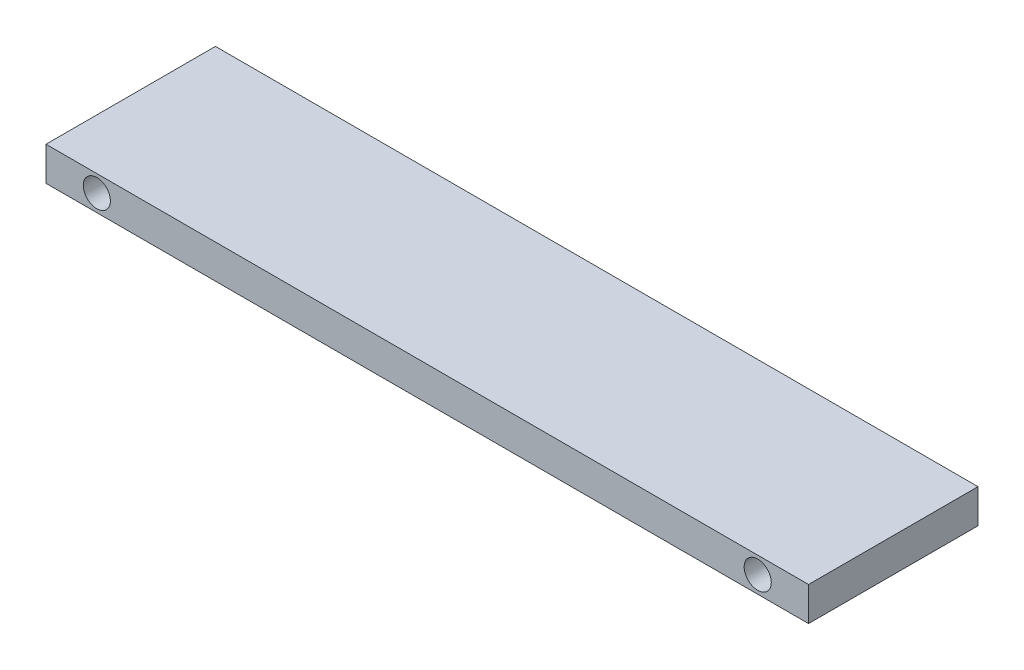
ISO-10303-21;
HEADER;
FILE_DESCRIPTION(('STEP AP214'),'2;1');
FILE_NAME('part.step','',(''),(''),'','','');
FILE_SCHEMA(('AUTOMOTIVE_DESIGN { 1 0 10303 214 1 1 1 1 }'));
ENDSEC;
DATA;
#1=APPLICATION_CONTEXT('core data for automotive mechanical design processes');
#2=APPLICATION_PROTOCOL_DEFINITION('international standard','automotive_design',2000,#1);
#3=PRODUCT_CONTEXT('',#1,'mechanical');
#4=PRODUCT('Part','Part','',(#3));
#5=PRODUCT_RELATED_PRODUCT_CATEGORY('part','',(#4));
#6=PRODUCT_DEFINITION_FORMATION('','',#4);
#7=PRODUCT_DEFINITION_CONTEXT('part definition',#1,'design');
#8=PRODUCT_DEFINITION('design','',#6,#7);
#9=PRODUCT_DEFINITION_SHAPE('','',#8);
#10=(LENGTH_UNIT() NAMED_UNIT(*) SI_UNIT(.MILLI.,.METRE.));
#11=(NAMED_UNIT(*) PLANE_ANGLE_UNIT() SI_UNIT($,.RADIAN.));
#12=(NAMED_UNIT(*) SI_UNIT($,.STERADIAN.) SOLID_ANGLE_UNIT());
#13=UNCERTAINTY_MEASURE_WITH_UNIT(LENGTH_MEASURE(1.E-05),#10,'distance_accuracy_value','');
#14=(GEOMETRIC_REPRESENTATION_CONTEXT(3) GLOBAL_UNCERTAINTY_ASSIGNED_CONTEXT((#13)) GLOBAL_UNIT_ASSIGNED_CONTEXT((#10,
#11,#12)) REPRESENTATION_CONTEXT('',''));
#15=CARTESIAN_POINT('',(0.,0.,0.));
#16=DIRECTION('',(0.,0.,1.));
#17=DIRECTION('',(1.,0.,0.));
#18=AXIS2_PLACEMENT_3D('',#15,#16,#17);
#19=CARTESIAN_POINT('',(225.,20.,50.));
#20=DIRECTION('',(-1.,0.,0.));
#21=DIRECTION('',(0.,0.,1.));
#22=AXIS2_PLACEMENT_3D('',#19,#20,#21);
#23=PLANE('',#22);
#24=DIRECTION('',(0.,0.,-1.));
#25=VECTOR('',#24,1.);
#26=CARTESIAN_POINT('',(225.,0.,50.));
#27=LINE('',#26,#25);
#28=CARTESIAN_POINT('',(225.,0.,50.));
#29=VERTEX_POINT('',#28);
#30=CARTESIAN_POINT('',(225.,0.,-50.));
#31=VERTEX_POINT('',#30);
#32=EDGE_CURVE('E96',#29,#31,#27,.T.);
#33=ORIENTED_EDGE('',*,*,#32,.T.);
#34=DIRECTION('',(0.,-1.,0.));
#35=VECTOR('',#34,1.);
#36=CARTESIAN_POINT('',(225.,20.,-50.));
#37=LINE('',#36,#35);
#38=CARTESIAN_POINT('',(225.,20.,-50.));
#39=VERTEX_POINT('',#38);
#40=EDGE_CURVE('E11',#39,#31,#37,.T.);
#41=ORIENTED_EDGE('',*,*,#40,.F.);
#42=DIRECTION('',(0.,0.,-1.));
#43=VECTOR('',#42,1.);
#44=CARTESIAN_POINT('',(225.,20.,50.));
#45=LINE('',#44,#43);
#46=CARTESIAN_POINT('',(225.,20.,50.));
#47=VERTEX_POINT('',#46);
#48=EDGE_CURVE('E84',#47,#39,#45,.T.);
#49=ORIENTED_EDGE('',*,*,#48,.F.);
#50=DIRECTION('',(0.,-1.,0.));
#51=VECTOR('',#50,1.);
#52=CARTESIAN_POINT('',(225.,20.,50.));
#53=LINE('',#52,#51);
#54=EDGE_CURVE('E92',#47,#29,#53,.T.);
#55=ORIENTED_EDGE('',*,*,#54,.T.);
#56=EDGE_LOOP('',(#33,#41,#49,#55));
#57=FACE_BOUND('',#56,.T.);
#58=ADVANCED_FACE('F33',(#57),#23,.F.);
#59=CARTESIAN_POINT('',(-225.,20.,-50.));
#60=DIRECTION('',(0.,0.,1.));
#61=DIRECTION('',(1.,0.,0.));
#62=AXIS2_PLACEMENT_3D('',#59,#60,#61);
#63=PLANE('',#62);
#64=CARTESIAN_POINT('',(-195.,10.,-50.));
#65=DIRECTION('',(0.,0.,1.));
#66=DIRECTION('',(-1.,0.,0.));
#67=AXIS2_PLACEMENT_3D('',#64,#65,#66);
#68=CIRCLE('',#67,7.99999999999998);
#69=CARTESIAN_POINT('',(-203.,10.,-50.));
#70=VERTEX_POINT('',#69);
#71=EDGE_CURVE('E113',#70,#70,#68,.T.);
#72=ORIENTED_EDGE('',*,*,#71,.T.);
#73=EDGE_LOOP('',(#72));
#74=FACE_BOUND('',#73,.T.);
#75=CARTESIAN_POINT('',(195.,10.,-50.));
#76=DIRECTION('',(0.,0.,1.));
#77=DIRECTION('',(1.,0.,0.));
#78=AXIS2_PLACEMENT_3D('',#75,#76,#77);
#79=CIRCLE('',#78,8.00000000000001);
#80=CARTESIAN_POINT('',(203.,10.,-50.));
#81=VERTEX_POINT('',#80);
#82=EDGE_CURVE('E99',#81,#81,#79,.T.);
#83=ORIENTED_EDGE('',*,*,#82,.T.);
#84=EDGE_LOOP('',(#83));
#85=FACE_BOUND('',#84,.T.);
#86=DIRECTION('',(-1.,0.,0.));
#87=VECTOR('',#86,1.);
#88=CARTESIAN_POINT('',(-225.,0.,-50.));
#89=LINE('',#88,#87);
#90=CARTESIAN_POINT('',(-225.,0.,-50.));
#91=VERTEX_POINT('',#90);
#92=EDGE_CURVE('E88',#31,#91,#89,.T.);
#93=ORIENTED_EDGE('',*,*,#92,.T.);
#94=DIRECTION('',(0.,-1.,0.));
#95=VECTOR('',#94,1.);
#96=CARTESIAN_POINT('',(-225.,20.,-50.));
#97=LINE('',#96,#95);
#98=CARTESIAN_POINT('',(-225.,20.,-50.));
#99=VERTEX_POINT('',#98);
#100=EDGE_CURVE('E41',#99,#91,#97,.T.);
#101=ORIENTED_EDGE('',*,*,#100,.F.);
#102=DIRECTION('',(-1.,0.,0.));
#103=VECTOR('',#102,1.);
#104=CARTESIAN_POINT('',(-225.,20.,-50.));
#105=LINE('',#104,#103);
#106=EDGE_CURVE('E79',#39,#99,#105,.T.);
#107=ORIENTED_EDGE('',*,*,#106,.F.);
#108=ORIENTED_EDGE('',*,*,#40,.T.);
#109=EDGE_LOOP('',(#93,#101,#107,#108));
#110=FACE_BOUND('',#109,.T.);
#111=ADVANCED_FACE('F87',(#74,#85,#110),#63,.F.);
#112=CARTESIAN_POINT('',(-225.,20.,50.));
#113=DIRECTION('',(1.,0.,0.));
#114=DIRECTION('',(0.,0.,-1.));
#115=AXIS2_PLACEMENT_3D('',#112,#113,#114);
#116=PLANE('',#115);
#117=DIRECTION('',(0.,0.,1.));
#118=VECTOR('',#117,1.);
#119=CARTESIAN_POINT('',(-225.,0.,50.));
#120=LINE('',#119,#118);
#121=CARTESIAN_POINT('',(-225.,0.,50.));
#122=VERTEX_POINT('',#121);
#123=EDGE_CURVE('E66',#91,#122,#120,.T.);
#124=ORIENTED_EDGE('',*,*,#123,.T.);
#125=DIRECTION('',(0.,-1.,0.));
#126=VECTOR('',#125,1.);
#127=CARTESIAN_POINT('',(-225.,20.,50.));
#128=LINE('',#127,#126);
#129=CARTESIAN_POINT('',(-225.,20.,50.));
#130=VERTEX_POINT('',#129);
#131=EDGE_CURVE('E89',#130,#122,#128,.T.);
#132=ORIENTED_EDGE('',*,*,#131,.F.);
#133=DIRECTION('',(0.,0.,1.));
#134=VECTOR('',#133,1.);
#135=CARTESIAN_POINT('',(-225.,20.,50.));
#136=LINE('',#135,#134);
#137=EDGE_CURVE('E82',#99,#130,#136,.T.);
#138=ORIENTED_EDGE('',*,*,#137,.F.);
#139=ORIENTED_EDGE('',*,*,#100,.T.);
#140=EDGE_LOOP('',(#124,#132,#138,#139));
#141=FACE_BOUND('',#140,.T.);
#142=ADVANCED_FACE('F90',(#141),#116,.F.);
#143=CARTESIAN_POINT('',(-225.,20.,50.));
#144=DIRECTION('',(0.,0.,-1.));
#145=DIRECTION('',(-1.,0.,0.));
#146=AXIS2_PLACEMENT_3D('',#143,#144,#145);
#147=PLANE('',#146);
#148=CARTESIAN_POINT('',(-195.,10.,50.));
#149=DIRECTION('',(0.,0.,1.));
#150=DIRECTION('',(-1.,0.,0.));
#151=AXIS2_PLACEMENT_3D('',#148,#149,#150);
#152=CIRCLE('',#151,7.99999999999998);
#153=CARTESIAN_POINT('',(-203.,10.,50.));
#154=VERTEX_POINT('',#153);
#155=EDGE_CURVE('E116',#154,#154,#152,.T.);
#156=ORIENTED_EDGE('',*,*,#155,.F.);
#157=EDGE_LOOP('',(#156));
#158=FACE_BOUND('',#157,.T.);
#159=CARTESIAN_POINT('',(195.,10.,50.));
#160=DIRECTION('',(0.,0.,1.));
#161=DIRECTION('',(1.,0.,0.));
#162=AXIS2_PLACEMENT_3D('',#159,#160,#161);
#163=CIRCLE('',#162,8.00000000000001);
#164=CARTESIAN_POINT('',(203.,10.,50.));
#165=VERTEX_POINT('',#164);
#166=EDGE_CURVE('E110',#165,#165,#163,.T.);
#167=ORIENTED_EDGE('',*,*,#166,.F.);
#168=EDGE_LOOP('',(#167));
#169=FACE_BOUND('',#168,.T.);
#170=DIRECTION('',(1.,0.,0.));
#171=VECTOR('',#170,1.);
#172=CARTESIAN_POINT('',(-225.,0.,50.));
#173=LINE('',#172,#171);
#174=EDGE_CURVE('E72',#122,#29,#173,.T.);
#175=ORIENTED_EDGE('',*,*,#174,.T.);
#176=ORIENTED_EDGE('',*,*,#54,.F.);
#177=DIRECTION('',(1.,0.,0.));
#178=VECTOR('',#177,1.);
#179=CARTESIAN_POINT('',(-225.,20.,50.));
#180=LINE('',#179,#178);
#181=EDGE_CURVE('E49',#130,#47,#180,.T.);
#182=ORIENTED_EDGE('',*,*,#181,.F.);
#183=ORIENTED_EDGE('',*,*,#131,.T.);
#184=EDGE_LOOP('',(#175,#176,#182,#183));
#185=FACE_BOUND('',#184,.T.);
#186=ADVANCED_FACE('F104',(#158,#169,#185),#147,.F.);
#187=CARTESIAN_POINT('',(0.,20.,0.));
#188=DIRECTION('',(0.,-1.,0.));
#189=DIRECTION('',(0.,0.,-1.));
#190=AXIS2_PLACEMENT_3D('',#187,#188,#189);
#191=PLANE('',#190);
#192=ORIENTED_EDGE('',*,*,#48,.T.);
#193=ORIENTED_EDGE('',*,*,#106,.T.);
#194=ORIENTED_EDGE('',*,*,#137,.T.);
#195=ORIENTED_EDGE('',*,*,#181,.T.);
#196=EDGE_LOOP('',(#192,#193,#194,#195));
#197=FACE_BOUND('',#196,.T.);
#198=ADVANCED_FACE('F80',(#197),#191,.F.);
#199=CARTESIAN_POINT('',(0.,0.,0.));
#200=DIRECTION('',(0.,-1.,0.));
#201=DIRECTION('',(0.,0.,-1.));
#202=AXIS2_PLACEMENT_3D('',#199,#200,#201);
#203=PLANE('',#202);
#204=ORIENTED_EDGE('',*,*,#32,.F.);
#205=ORIENTED_EDGE('',*,*,#174,.F.);
#206=ORIENTED_EDGE('',*,*,#123,.F.);
#207=ORIENTED_EDGE('',*,*,#92,.F.);
#208=EDGE_LOOP('',(#204,#205,#206,#207));
#209=FACE_BOUND('',#208,.T.);
#210=ADVANCED_FACE('F107',(#209),#203,.T.);
#211=CARTESIAN_POINT('',(195.,10.,-50.));
#212=DIRECTION('',(0.,0.,1.));
#213=DIRECTION('',(1.,0.,0.));
#214=AXIS2_PLACEMENT_3D('',#211,#212,#213);
#215=CYLINDRICAL_SURFACE('',#214,8.00000000000001);
#216=ORIENTED_EDGE('',*,*,#82,.F.);
#217=EDGE_LOOP('',(#216));
#218=FACE_BOUND('',#217,.T.);
#219=ORIENTED_EDGE('',*,*,#166,.T.);
#220=EDGE_LOOP('',(#219));
#221=FACE_BOUND('',#220,.T.);
#222=ADVANCED_FACE('F127',(#218,#221),#215,.F.);
#223=CARTESIAN_POINT('',(-195.,10.,-50.));
#224=DIRECTION('',(0.,0.,1.));
#225=DIRECTION('',(1.,0.,0.));
#226=AXIS2_PLACEMENT_3D('',#223,#224,#225);
#227=CYLINDRICAL_SURFACE('',#226,7.99999999999998);
#228=ORIENTED_EDGE('',*,*,#71,.F.);
#229=EDGE_LOOP('',(#228));
#230=FACE_BOUND('',#229,.T.);
#231=ORIENTED_EDGE('',*,*,#155,.T.);
#232=EDGE_LOOP('',(#231));
#233=FACE_BOUND('',#232,.T.);
#234=ADVANCED_FACE('F124',(#230,#233),#227,.F.);
#235=CLOSED_SHELL('',(#58,#111,#142,#186,#198,#210,#222,#234));
#236=MANIFOLD_SOLID_BREP('B2',#235);
#237=ADVANCED_BREP_SHAPE_REPRESENTATION('',(#18,#236),#14);
#238=SHAPE_DEFINITION_REPRESENTATION(#9,#237);
ENDSEC;
END-ISO-10303-21;
